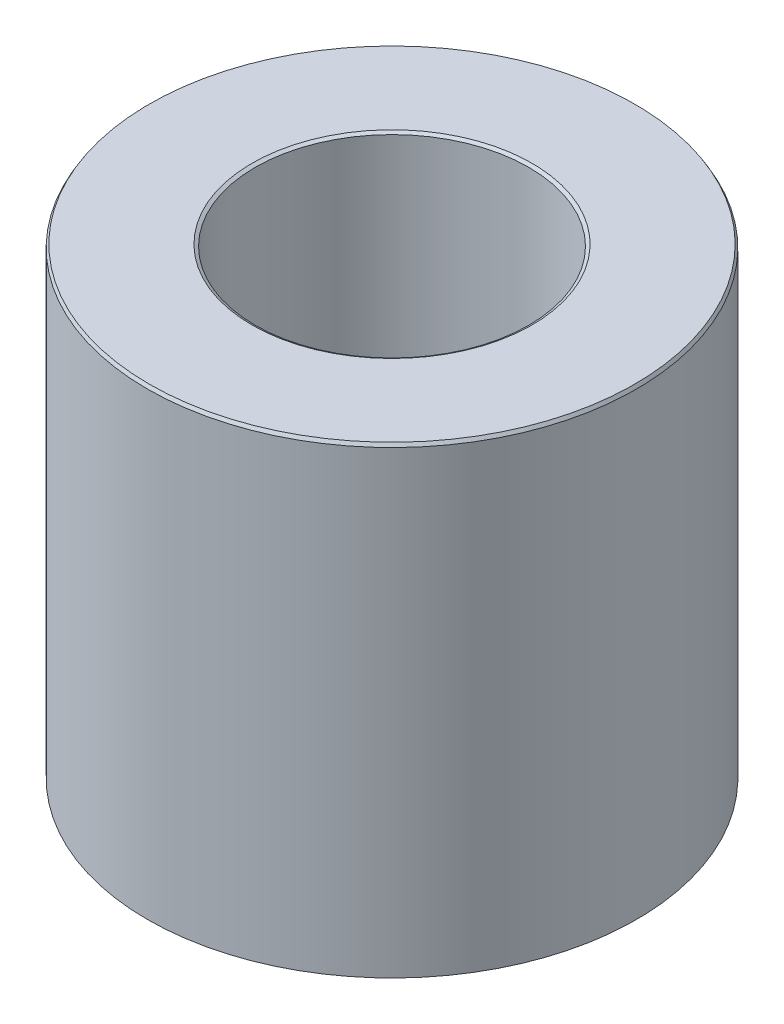
ISO-10303-21;
HEADER;
FILE_DESCRIPTION(('STEP AP214'),'2;1');
FILE_NAME('part.step','',(''),(''),'','','');
FILE_SCHEMA(('AUTOMOTIVE_DESIGN { 1 0 10303 214 1 1 1 1 }'));
ENDSEC;
DATA;
#1=APPLICATION_CONTEXT('core data for automotive mechanical design processes');
#2=APPLICATION_PROTOCOL_DEFINITION('international standard','automotive_design',2000,#1);
#3=PRODUCT_CONTEXT('',#1,'mechanical');
#4=PRODUCT('Part','Part','',(#3));
#5=PRODUCT_RELATED_PRODUCT_CATEGORY('part','',(#4));
#6=PRODUCT_DEFINITION_FORMATION('','',#4);
#7=PRODUCT_DEFINITION_CONTEXT('part definition',#1,'design');
#8=PRODUCT_DEFINITION('design','',#6,#7);
#9=PRODUCT_DEFINITION_SHAPE('','',#8);
#10=(LENGTH_UNIT() NAMED_UNIT(*) SI_UNIT(.MILLI.,.METRE.));
#11=(NAMED_UNIT(*) PLANE_ANGLE_UNIT() SI_UNIT($,.RADIAN.));
#12=(NAMED_UNIT(*) SI_UNIT($,.STERADIAN.) SOLID_ANGLE_UNIT());
#13=UNCERTAINTY_MEASURE_WITH_UNIT(LENGTH_MEASURE(1.E-05),#10,'distance_accuracy_value','');
#14=(GEOMETRIC_REPRESENTATION_CONTEXT(3) GLOBAL_UNCERTAINTY_ASSIGNED_CONTEXT((#13)) GLOBAL_UNIT_ASSIGNED_CONTEXT((#10,
#11,#12)) REPRESENTATION_CONTEXT('',''));
#15=CARTESIAN_POINT('',(0.,0.,0.));
#16=DIRECTION('',(0.,0.,1.));
#17=DIRECTION('',(1.,0.,0.));
#18=AXIS2_PLACEMENT_3D('',#15,#16,#17);
#19=CARTESIAN_POINT('',(0.,109.231537179869,0.));
#20=DIRECTION('',(0.,-1.,0.));
#21=DIRECTION('',(0.,0.,-1.));
#22=AXIS2_PLACEMENT_3D('',#19,#20,#21);
#23=CYLINDRICAL_SURFACE('',#22,57.5);
#24=CARTESIAN_POINT('',(0.,0.44175348932074,0.));
#25=DIRECTION('',(0.,1.,0.));
#26=DIRECTION('',(0.,0.,1.));
#27=AXIS2_PLACEMENT_3D('',#24,#25,#26);
#28=CIRCLE('',#27,57.5);
#29=CARTESIAN_POINT('',(0.,0.44175348932074,57.5));
#30=VERTEX_POINT('',#29);
#31=EDGE_CURVE('E10',#30,#30,#28,.T.);
#32=ORIENTED_EDGE('',*,*,#31,.T.);
#33=EDGE_LOOP('',(#32));
#34=FACE_BOUND('',#33,.T.);
#35=CARTESIAN_POINT('',(0.,108.466397691945,0.));
#36=DIRECTION('',(0.,1.,0.));
#37=DIRECTION('',(0.,0.,1.));
#38=AXIS2_PLACEMENT_3D('',#35,#36,#37);
#39=CIRCLE('',#38,57.5);
#40=CARTESIAN_POINT('',(0.,108.466397691945,57.5));
#41=VERTEX_POINT('',#40);
#42=EDGE_CURVE('E50',#41,#41,#39,.F.);
#43=ORIENTED_EDGE('',*,*,#42,.T.);
#44=EDGE_LOOP('',(#43));
#45=FACE_BOUND('',#44,.T.);
#46=ADVANCED_FACE('F39',(#34,#45),#23,.T.);
#47=CARTESIAN_POINT('',(0.,109.231537179869,0.));
#48=DIRECTION('',(0.,1.,0.));
#49=DIRECTION('',(0.,0.,1.));
#50=AXIS2_PLACEMENT_3D('',#47,#48,#49);
#51=PLANE('',#50);
#52=CARTESIAN_POINT('',(0.,109.231537179869,0.));
#53=DIRECTION('',(0.,1.,0.));
#54=DIRECTION('',(0.,0.,1.));
#55=AXIS2_PLACEMENT_3D('',#52,#53,#54);
#56=CIRCLE('',#55,32.9348990643341);
#57=CARTESIAN_POINT('',(0.,109.231537179869,32.9348990643341));
#58=VERTEX_POINT('',#57);
#59=EDGE_CURVE('E58',#58,#58,#56,.F.);
#60=ORIENTED_EDGE('',*,*,#59,.T.);
#61=EDGE_LOOP('',(#60));
#62=FACE_BOUND('',#61,.T.);
#63=CARTESIAN_POINT('',(0.,109.231537179869,0.));
#64=DIRECTION('',(0.,1.,0.));
#65=DIRECTION('',(0.,0.,1.));
#66=AXIS2_PLACEMENT_3D('',#63,#64,#65);
#67=CIRCLE('',#66,57.0582465106792);
#68=CARTESIAN_POINT('',(0.,109.231537179869,57.0582465106792));
#69=VERTEX_POINT('',#68);
#70=EDGE_CURVE('E61',#69,#69,#67,.T.);
#71=ORIENTED_EDGE('',*,*,#70,.T.);
#72=EDGE_LOOP('',(#71));
#73=FACE_BOUND('',#72,.T.);
#74=ADVANCED_FACE('F88',(#62,#73),#51,.T.);
#75=CARTESIAN_POINT('',(0.,0.,0.));
#76=DIRECTION('',(0.,1.,0.));
#77=DIRECTION('',(0.,0.,1.));
#78=AXIS2_PLACEMENT_3D('',#75,#76,#77);
#79=PLANE('',#78);
#80=CARTESIAN_POINT('',(0.,0.,0.));
#81=DIRECTION('',(0.,1.,0.));
#82=DIRECTION('',(0.,0.,1.));
#83=AXIS2_PLACEMENT_3D('',#80,#81,#82);
#84=CIRCLE('',#83,32.6115130657305);
#85=CARTESIAN_POINT('',(0.,0.,32.6115130657305));
#86=VERTEX_POINT('',#85);
#87=EDGE_CURVE('E51',#86,#86,#84,.T.);
#88=ORIENTED_EDGE('',*,*,#87,.T.);
#89=EDGE_LOOP('',(#88));
#90=FACE_BOUND('',#89,.T.);
#91=CARTESIAN_POINT('',(0.,0.,0.));
#92=DIRECTION('',(0.,1.,0.));
#93=DIRECTION('',(0.,0.,1.));
#94=AXIS2_PLACEMENT_3D('',#91,#92,#93);
#95=CIRCLE('',#94,56.7348605120756);
#96=CARTESIAN_POINT('',(0.,0.,56.7348605120756));
#97=VERTEX_POINT('',#96);
#98=EDGE_CURVE('E54',#97,#97,#95,.F.);
#99=ORIENTED_EDGE('',*,*,#98,.T.);
#100=EDGE_LOOP('',(#99));
#101=FACE_BOUND('',#100,.T.);
#102=ADVANCED_FACE('F83',(#90,#101),#79,.F.);
#103=CARTESIAN_POINT('',(0.,109.231537179869,0.));
#104=DIRECTION('',(0.,-1.,0.));
#105=DIRECTION('',(0.,0.,-1.));
#106=AXIS2_PLACEMENT_3D('',#103,#104,#105);
#107=CYLINDRICAL_SURFACE('',#106,32.1697595764097);
#108=CARTESIAN_POINT('',(0.,108.789783690548,0.));
#109=DIRECTION('',(0.,1.,0.));
#110=DIRECTION('',(0.,0.,1.));
#111=AXIS2_PLACEMENT_3D('',#108,#109,#110);
#112=CIRCLE('',#111,32.1697595764097);
#113=CARTESIAN_POINT('',(0.,108.789783690548,32.1697595764097));
#114=VERTEX_POINT('',#113);
#115=EDGE_CURVE('E67',#114,#114,#112,.T.);
#116=ORIENTED_EDGE('',*,*,#115,.T.);
#117=EDGE_LOOP('',(#116));
#118=FACE_BOUND('',#117,.T.);
#119=CARTESIAN_POINT('',(0.,0.765139487924393,0.));
#120=DIRECTION('',(0.,1.,0.));
#121=DIRECTION('',(0.,0.,1.));
#122=AXIS2_PLACEMENT_3D('',#119,#120,#121);
#123=CIRCLE('',#122,32.1697595764097);
#124=CARTESIAN_POINT('',(0.,0.765139487924393,32.1697595764097));
#125=VERTEX_POINT('',#124);
#126=EDGE_CURVE('E69',#125,#125,#123,.F.);
#127=ORIENTED_EDGE('',*,*,#126,.T.);
#128=EDGE_LOOP('',(#127));
#129=FACE_BOUND('',#128,.T.);
#130=ADVANCED_FACE('F71',(#118,#129),#107,.F.);
#131=CARTESIAN_POINT('',(0.,108.789783690548,0.));
#132=DIRECTION('',(0.,1.,0.));
#133=DIRECTION('',(0.,0.,1.));
#134=AXIS2_PLACEMENT_3D('',#131,#132,#133);
#135=CONICAL_SURFACE('',#134,32.1697595764097,1.0471975511966);
#136=ORIENTED_EDGE('',*,*,#59,.F.);
#137=EDGE_LOOP('',(#136));
#138=FACE_BOUND('',#137,.T.);
#139=ORIENTED_EDGE('',*,*,#115,.F.);
#140=EDGE_LOOP('',(#139));
#141=FACE_BOUND('',#140,.T.);
#142=ADVANCED_FACE('F77',(#138,#141),#135,.F.);
#143=CARTESIAN_POINT('',(0.,0.,0.));
#144=DIRECTION('',(0.,-1.,0.));
#145=DIRECTION('',(0.,0.,-1.));
#146=AXIS2_PLACEMENT_3D('',#143,#144,#145);
#147=CONICAL_SURFACE('',#146,32.6115130657305,0.523598775598299);
#148=ORIENTED_EDGE('',*,*,#126,.F.);
#149=EDGE_LOOP('',(#148));
#150=FACE_BOUND('',#149,.T.);
#151=ORIENTED_EDGE('',*,*,#87,.F.);
#152=EDGE_LOOP('',(#151));
#153=FACE_BOUND('',#152,.T.);
#154=ADVANCED_FACE('F73',(#150,#153),#147,.F.);
#155=CARTESIAN_POINT('',(0.,0.44175348932074,0.));
#156=DIRECTION('',(0.,1.,0.));
#157=DIRECTION('',(0.,0.,1.));
#158=AXIS2_PLACEMENT_3D('',#155,#156,#157);
#159=CONICAL_SURFACE('',#158,57.5,1.04719755119661);
#160=CARTESIAN_POINT('',(0.,0.,56.7348605120756));
#161=CARTESIAN_POINT('',(0.,0.00460159884708957,56.7428307150748));
#162=CARTESIAN_POINT('',(0.,0.00920319769418107,56.750800918074));
#163=CARTESIAN_POINT('',(0.,0.0184063953883641,56.7667413240725));
#164=CARTESIAN_POINT('',(0.,0.0230079942354556,56.7747115270717));
#165=CARTESIAN_POINT('',(0.,0.0322111919296378,56.7906519330701));
#166=CARTESIAN_POINT('',(0.,0.0368127907767286,56.7986221360693));
#167=CARTESIAN_POINT('',(0.,0.04601598847091,56.8145625420677));
#168=CARTESIAN_POINT('',(0.,0.0506175873180007,56.822532745067));
#169=CARTESIAN_POINT('',(0.,0.0598207850121831,56.8384731510654));
#170=CARTESIAN_POINT('',(0.,0.0644223838592748,56.8464433540646));
#171=CARTESIAN_POINT('',(0.,0.0736255815534572,56.862383760063));
#172=CARTESIAN_POINT('',(0.,0.078227180400548,56.8703539630622));
#173=CARTESIAN_POINT('',(0.,0.0874303780947294,56.8862943690607));
#174=CARTESIAN_POINT('',(0.,0.09203197694182,56.8942645720599));
#175=CARTESIAN_POINT('',(0.,0.101235174636002,56.9102049780583));
#176=CARTESIAN_POINT('',(0.,0.105836773483094,56.9181751810575));
#177=CARTESIAN_POINT('',(0.,0.115039971177277,56.9341155870559));
#178=CARTESIAN_POINT('',(0.,0.119641570024367,56.9420857900551));
#179=CARTESIAN_POINT('',(0.,0.128844767718549,56.9580261960536));
#180=CARTESIAN_POINT('',(0.,0.13344636656564,56.9659963990528));
#181=CARTESIAN_POINT('',(0.,0.142649564259822,56.9819368050512));
#182=CARTESIAN_POINT('',(0.,0.147251163106913,56.9899070080504));
#183=CARTESIAN_POINT('',(0.,0.156454360801095,57.0058474140488));
#184=CARTESIAN_POINT('',(0.,0.161055959648187,57.0138176170481));
#185=CARTESIAN_POINT('',(0.,0.170259157342369,57.0297580230465));
#186=CARTESIAN_POINT('',(0.,0.17486075618946,57.0377282260457));
#187=CARTESIAN_POINT('',(0.,0.184063953883641,57.0536686320441));
#188=CARTESIAN_POINT('',(0.,0.188665552730732,57.0616388350433));
#189=CARTESIAN_POINT('',(0.,0.197868750424914,57.0775792410418));
#190=CARTESIAN_POINT('',(0.,0.202470349272006,57.085549444041));
#191=CARTESIAN_POINT('',(0.,0.211673546966188,57.1014898500394));
#192=CARTESIAN_POINT('',(0.,0.216275145813279,57.1094600530386));
#193=CARTESIAN_POINT('',(0.,0.225478343507461,57.125400459037));
#194=CARTESIAN_POINT('',(0.,0.230079942354551,57.1333706620362));
#195=CARTESIAN_POINT('',(0.,0.239283140048734,57.1493110680347));
#196=CARTESIAN_POINT('',(0.,0.243884738895825,57.1572812710339));
#197=CARTESIAN_POINT('',(0.,0.253087936590008,57.1732216770323));
#198=CARTESIAN_POINT('',(0.,0.257689535437099,57.1811918800315));
#199=CARTESIAN_POINT('',(0.,0.26689273313128,57.1971322860299));
#200=CARTESIAN_POINT('',(0.,0.271494331978371,57.2051024890292));
#201=CARTESIAN_POINT('',(0.,0.280697529672553,57.2210428950276));
#202=CARTESIAN_POINT('',(0.,0.285299128519645,57.2290130980268));
#203=CARTESIAN_POINT('',(0.,0.294502326213827,57.2449535040252));
#204=CARTESIAN_POINT('',(0.,0.299103925060918,57.2529237070244));
#205=CARTESIAN_POINT('',(0.,0.3083071227551,57.2688641130228));
#206=CARTESIAN_POINT('',(0.,0.312908721602191,57.2768343160221));
#207=CARTESIAN_POINT('',(0.,0.322111919296373,57.2927747220205));
#208=CARTESIAN_POINT('',(0.,0.326713518143463,57.3007449250197));
#209=CARTESIAN_POINT('',(0.,0.335916715837645,57.3166853310181));
#210=CARTESIAN_POINT('',(0.,0.340518314684737,57.3246555340173));
#211=CARTESIAN_POINT('',(0.,0.34972151237892,57.3405959400158));
#212=CARTESIAN_POINT('',(0.,0.35432311122601,57.348566143015));
#213=CARTESIAN_POINT('',(0.,0.363526308920192,57.3645065490134));
#214=CARTESIAN_POINT('',(0.,0.368127907767282,57.3724767520126));
#215=CARTESIAN_POINT('',(0.,0.377331105461465,57.388417158011));
#216=CARTESIAN_POINT('',(0.,0.381932704308557,57.3963873610102));
#217=CARTESIAN_POINT('',(0.,0.391135902002739,57.4123277670087));
#218=CARTESIAN_POINT('',(0.,0.39573750084983,57.4202979700079));
#219=CARTESIAN_POINT('',(0.,0.404940698544011,57.4362383760063));
#220=CARTESIAN_POINT('',(0.,0.409542297391102,57.4442085790055));
#221=CARTESIAN_POINT('',(0.,0.418745495085284,57.4601489850039));
#222=CARTESIAN_POINT('',(0.,0.423347093932376,57.4681191880032));
#223=CARTESIAN_POINT('',(0.,0.432550291626559,57.4840595940016));
#224=CARTESIAN_POINT('',(0.,0.43715189047365,57.4920297970008));
#225=CARTESIAN_POINT('',(0.,0.44175348932074,57.5));
#226=B_SPLINE_CURVE_WITH_KNOTS('',3,(#160,#161,#162,#163,#164,#165,#166,#167,#168,#169,#170,
#171,#172,#173,#174,#175,#176,#177,#178,#179,#180,#181,#182,#183,#184,#185,#186,#187,#188,#189,
#190,#191,#192,#193,#194,#195,#196,#197,#198,#199,#200,#201,#202,#203,#204,#205,#206,#207,#208,
#209,#210,#211,#212,#213,#214,#215,#216,#217,#218,#219,#220,#221,#222,#223,#224,#225),
.UNSPECIFIED.,.F.,.F.,(4,2,2,2,2,2,2,2,2,2,2,2,2,2,2,2,2,2,2,2,2,2,2,2,2,2,2,2,2,2,2,2,4),(0.,
0.0276095930825487,0.0552191861650915,0.0828287792476402,0.110438372330189,0.138047965412732,
0.16565755849528,0.193267151577829,0.220876744660372,0.248486337742921,0.276095930825469,
0.303705523908018,0.331315116990561,0.358924710073109,0.386534303155658,0.414143896238201,
0.44175348932075,0.469363082403298,0.496972675485841,0.52458226856839,0.552191861650939,
0.579801454733481,0.60741104781603,0.635020640898579,0.662630233981128,0.69023982706367,
0.717849420146219,0.745459013228768,0.773068606311311,0.800678199393859,0.828287792476408,
0.855897385558951,0.8835069786415),.UNSPECIFIED.);
#227=EDGE_CURVE('BSEAM76',#97,#30,#226,.T.);
#228=ORIENTED_EDGE('',*,*,#98,.F.);
#229=ORIENTED_EDGE('',*,*,#31,.F.);
#230=ORIENTED_EDGE('',*,*,#227,.T.);
#231=ORIENTED_EDGE('',*,*,#227,.F.);
#232=EDGE_LOOP('',(#228,#230,#229,#231));
#233=FACE_BOUND('',#232,.T.);
#234=ADVANCED_FACE('F76',(#233),#159,.T.);
#235=CARTESIAN_POINT('',(0.,109.231537179869,0.));
#236=DIRECTION('',(0.,-1.,0.));
#237=DIRECTION('',(0.,0.,-1.));
#238=AXIS2_PLACEMENT_3D('',#235,#236,#237);
#239=CONICAL_SURFACE('',#238,57.0582465106792,0.523598775598306);
#240=ORIENTED_EDGE('',*,*,#42,.F.);
#241=EDGE_LOOP('',(#240));
#242=FACE_BOUND('',#241,.T.);
#243=ORIENTED_EDGE('',*,*,#70,.F.);
#244=EDGE_LOOP('',(#243));
#245=FACE_BOUND('',#244,.T.);
#246=ADVANCED_FACE('F45',(#242,#245),#239,.T.);
#247=CLOSED_SHELL('',(#46,#74,#102,#130,#142,#154,#234,#246));
#248=MANIFOLD_SOLID_BREP('B2',#247);
#249=ADVANCED_BREP_SHAPE_REPRESENTATION('',(#18,#248),#14);
#250=SHAPE_DEFINITION_REPRESENTATION(#9,#249);
ENDSEC;
END-ISO-10303-21;
